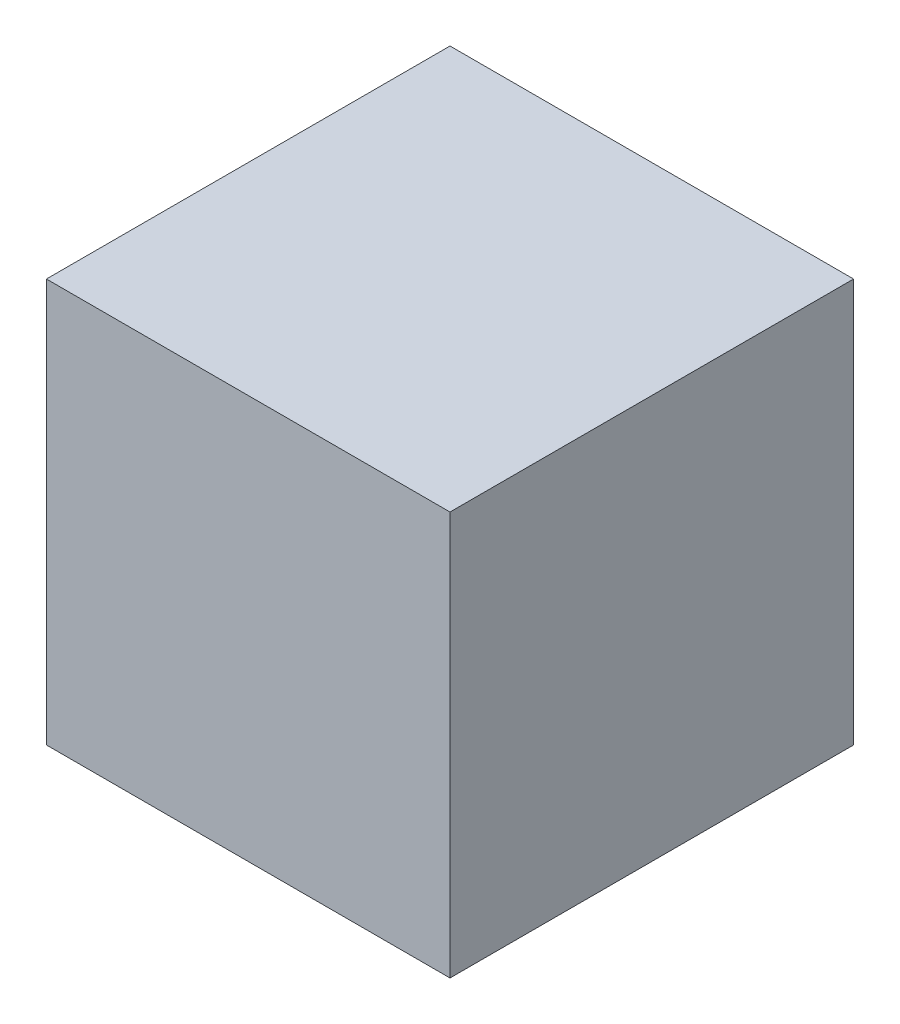
ISO-10303-21;
HEADER;
FILE_DESCRIPTION(('STEP AP214'),'2;1');
FILE_NAME('part.step','',(''),(''),'','','');
FILE_SCHEMA(('AUTOMOTIVE_DESIGN { 1 0 10303 214 1 1 1 1 }'));
ENDSEC;
DATA;
#1=APPLICATION_CONTEXT('core data for automotive mechanical design processes');
#2=APPLICATION_PROTOCOL_DEFINITION('international standard','automotive_design',2000,#1);
#3=PRODUCT_CONTEXT('',#1,'mechanical');
#4=PRODUCT('Part','Part','',(#3));
#5=PRODUCT_RELATED_PRODUCT_CATEGORY('part','',(#4));
#6=PRODUCT_DEFINITION_FORMATION('','',#4);
#7=PRODUCT_DEFINITION_CONTEXT('part definition',#1,'design');
#8=PRODUCT_DEFINITION('design','',#6,#7);
#9=PRODUCT_DEFINITION_SHAPE('','',#8);
#10=(LENGTH_UNIT() NAMED_UNIT(*) SI_UNIT(.MILLI.,.METRE.));
#11=(NAMED_UNIT(*) PLANE_ANGLE_UNIT() SI_UNIT($,.RADIAN.));
#12=(NAMED_UNIT(*) SI_UNIT($,.STERADIAN.) SOLID_ANGLE_UNIT());
#13=UNCERTAINTY_MEASURE_WITH_UNIT(LENGTH_MEASURE(1.E-05),#10,'distance_accuracy_value','');
#14=(GEOMETRIC_REPRESENTATION_CONTEXT(3) GLOBAL_UNCERTAINTY_ASSIGNED_CONTEXT((#13)) GLOBAL_UNIT_ASSIGNED_CONTEXT((#10,
#11,#12)) REPRESENTATION_CONTEXT('',''));
#15=CARTESIAN_POINT('',(0.,0.,0.));
#16=DIRECTION('',(0.,0.,1.));
#17=DIRECTION('',(1.,0.,0.));
#18=AXIS2_PLACEMENT_3D('',#15,#16,#17);
#19=CARTESIAN_POINT('',(26.9875,26.9875,26.9875));
#20=DIRECTION('',(-1.,0.,0.));
#21=DIRECTION('',(0.,0.,1.));
#22=AXIS2_PLACEMENT_3D('',#19,#20,#21);
#23=PLANE('',#22);
#24=DIRECTION('',(0.,0.,-1.));
#25=VECTOR('',#24,1.);
#26=CARTESIAN_POINT('',(26.9875,-26.9875,26.9875));
#27=LINE('',#26,#25);
#28=CARTESIAN_POINT('',(26.9875,-26.9875,26.9875));
#29=VERTEX_POINT('',#28);
#30=CARTESIAN_POINT('',(26.9875,-26.9875,-26.9875));
#31=VERTEX_POINT('',#30);
#32=EDGE_CURVE('E107',#29,#31,#27,.T.);
#33=ORIENTED_EDGE('',*,*,#32,.T.);
#34=DIRECTION('',(0.,-1.,0.));
#35=VECTOR('',#34,1.);
#36=CARTESIAN_POINT('',(26.9875,26.9875,-26.9875));
#37=LINE('',#36,#35);
#38=CARTESIAN_POINT('',(26.9875,26.9875,-26.9875));
#39=VERTEX_POINT('',#38);
#40=EDGE_CURVE('E11',#39,#31,#37,.T.);
#41=ORIENTED_EDGE('',*,*,#40,.F.);
#42=DIRECTION('',(0.,0.,-1.));
#43=VECTOR('',#42,1.);
#44=CARTESIAN_POINT('',(26.9875,26.9875,26.9875));
#45=LINE('',#44,#43);
#46=CARTESIAN_POINT('',(26.9875,26.9875,26.9875));
#47=VERTEX_POINT('',#46);
#48=EDGE_CURVE('E91',#47,#39,#45,.T.);
#49=ORIENTED_EDGE('',*,*,#48,.F.);
#50=DIRECTION('',(0.,-1.,0.));
#51=VECTOR('',#50,1.);
#52=CARTESIAN_POINT('',(26.9875,26.9875,26.9875));
#53=LINE('',#52,#51);
#54=EDGE_CURVE('E103',#47,#29,#53,.T.);
#55=ORIENTED_EDGE('',*,*,#54,.T.);
#56=EDGE_LOOP('',(#33,#41,#49,#55));
#57=FACE_BOUND('',#56,.T.);
#58=ADVANCED_FACE('F39',(#57),#23,.F.);
#59=CARTESIAN_POINT('',(-26.9875,26.9875,-26.9875));
#60=DIRECTION('',(0.,0.,1.));
#61=DIRECTION('',(1.,0.,0.));
#62=AXIS2_PLACEMENT_3D('',#59,#60,#61);
#63=PLANE('',#62);
#64=DIRECTION('',(-1.,0.,0.));
#65=VECTOR('',#64,1.);
#66=CARTESIAN_POINT('',(-26.9875,-26.9875,-26.9875));
#67=LINE('',#66,#65);
#68=CARTESIAN_POINT('',(-26.9875,-26.9875,-26.9875));
#69=VERTEX_POINT('',#68);
#70=EDGE_CURVE('E96',#31,#69,#67,.T.);
#71=ORIENTED_EDGE('',*,*,#70,.T.);
#72=DIRECTION('',(0.,-1.,0.));
#73=VECTOR('',#72,1.);
#74=CARTESIAN_POINT('',(-26.9875,26.9875,-26.9875));
#75=LINE('',#74,#73);
#76=CARTESIAN_POINT('',(-26.9875,26.9875,-26.9875));
#77=VERTEX_POINT('',#76);
#78=EDGE_CURVE('E48',#77,#69,#75,.T.);
#79=ORIENTED_EDGE('',*,*,#78,.F.);
#80=DIRECTION('',(-1.,0.,0.));
#81=VECTOR('',#80,1.);
#82=CARTESIAN_POINT('',(-26.9875,26.9875,-26.9875));
#83=LINE('',#82,#81);
#84=EDGE_CURVE('E86',#39,#77,#83,.T.);
#85=ORIENTED_EDGE('',*,*,#84,.F.);
#86=ORIENTED_EDGE('',*,*,#40,.T.);
#87=EDGE_LOOP('',(#71,#79,#85,#86));
#88=FACE_BOUND('',#87,.T.);
#89=ADVANCED_FACE('F95',(#88),#63,.F.);
#90=CARTESIAN_POINT('',(-26.9875,26.9875,26.9875));
#91=DIRECTION('',(1.,0.,0.));
#92=DIRECTION('',(0.,0.,-1.));
#93=AXIS2_PLACEMENT_3D('',#90,#91,#92);
#94=PLANE('',#93);
#95=DIRECTION('',(0.,0.,1.));
#96=VECTOR('',#95,1.);
#97=CARTESIAN_POINT('',(-26.9875,-26.9875,26.9875));
#98=LINE('',#97,#96);
#99=CARTESIAN_POINT('',(-26.9875,-26.9875,26.9875));
#100=VERTEX_POINT('',#99);
#101=EDGE_CURVE('E73',#69,#100,#98,.T.);
#102=ORIENTED_EDGE('',*,*,#101,.T.);
#103=DIRECTION('',(0.,-1.,0.));
#104=VECTOR('',#103,1.);
#105=CARTESIAN_POINT('',(-26.9875,26.9875,26.9875));
#106=LINE('',#105,#104);
#107=CARTESIAN_POINT('',(-26.9875,26.9875,26.9875));
#108=VERTEX_POINT('',#107);
#109=EDGE_CURVE('E98',#108,#100,#106,.T.);
#110=ORIENTED_EDGE('',*,*,#109,.F.);
#111=DIRECTION('',(0.,0.,1.));
#112=VECTOR('',#111,1.);
#113=CARTESIAN_POINT('',(-26.9875,26.9875,26.9875));
#114=LINE('',#113,#112);
#115=EDGE_CURVE('E89',#77,#108,#114,.T.);
#116=ORIENTED_EDGE('',*,*,#115,.F.);
#117=ORIENTED_EDGE('',*,*,#78,.T.);
#118=EDGE_LOOP('',(#102,#110,#116,#117));
#119=FACE_BOUND('',#118,.T.);
#120=ADVANCED_FACE('F99',(#119),#94,.F.);
#121=CARTESIAN_POINT('',(-26.9875,26.9875,26.9875));
#122=DIRECTION('',(0.,0.,-1.));
#123=DIRECTION('',(-1.,0.,0.));
#124=AXIS2_PLACEMENT_3D('',#121,#122,#123);
#125=PLANE('',#124);
#126=DIRECTION('',(1.,0.,0.));
#127=VECTOR('',#126,1.);
#128=CARTESIAN_POINT('',(-26.9875,-26.9875,26.9875));
#129=LINE('',#128,#127);
#130=EDGE_CURVE('E79',#100,#29,#129,.T.);
#131=ORIENTED_EDGE('',*,*,#130,.T.);
#132=ORIENTED_EDGE('',*,*,#54,.F.);
#133=DIRECTION('',(1.,0.,0.));
#134=VECTOR('',#133,1.);
#135=CARTESIAN_POINT('',(-26.9875,26.9875,26.9875));
#136=LINE('',#135,#134);
#137=EDGE_CURVE('E56',#108,#47,#136,.T.);
#138=ORIENTED_EDGE('',*,*,#137,.F.);
#139=ORIENTED_EDGE('',*,*,#109,.T.);
#140=EDGE_LOOP('',(#131,#132,#138,#139));
#141=FACE_BOUND('',#140,.T.);
#142=ADVANCED_FACE('F120',(#141),#125,.F.);
#143=CARTESIAN_POINT('',(0.,26.9875,0.));
#144=DIRECTION('',(0.,-1.,0.));
#145=DIRECTION('',(0.,0.,-1.));
#146=AXIS2_PLACEMENT_3D('',#143,#144,#145);
#147=PLANE('',#146);
#148=ORIENTED_EDGE('',*,*,#48,.T.);
#149=ORIENTED_EDGE('',*,*,#84,.T.);
#150=ORIENTED_EDGE('',*,*,#115,.T.);
#151=ORIENTED_EDGE('',*,*,#137,.T.);
#152=EDGE_LOOP('',(#148,#149,#150,#151));
#153=FACE_BOUND('',#152,.T.);
#154=ADVANCED_FACE('F87',(#153),#147,.F.);
#155=CARTESIAN_POINT('',(0.,-26.9875,0.));
#156=DIRECTION('',(0.,-1.,0.));
#157=DIRECTION('',(0.,0.,-1.));
#158=AXIS2_PLACEMENT_3D('',#155,#156,#157);
#159=PLANE('',#158);
#160=ORIENTED_EDGE('',*,*,#32,.F.);
#161=ORIENTED_EDGE('',*,*,#130,.F.);
#162=ORIENTED_EDGE('',*,*,#101,.F.);
#163=ORIENTED_EDGE('',*,*,#70,.F.);
#164=EDGE_LOOP('',(#160,#161,#162,#163));
#165=FACE_BOUND('',#164,.T.);
#166=ADVANCED_FACE('F123',(#165),#159,.T.);
#167=CLOSED_SHELL('',(#58,#89,#120,#142,#154,#166));
#168=MANIFOLD_SOLID_BREP('B2',#167);
#169=ADVANCED_BREP_SHAPE_REPRESENTATION('',(#18,#168),#14);
#170=SHAPE_DEFINITION_REPRESENTATION(#9,#169);
ENDSEC;
END-ISO-10303-21;
